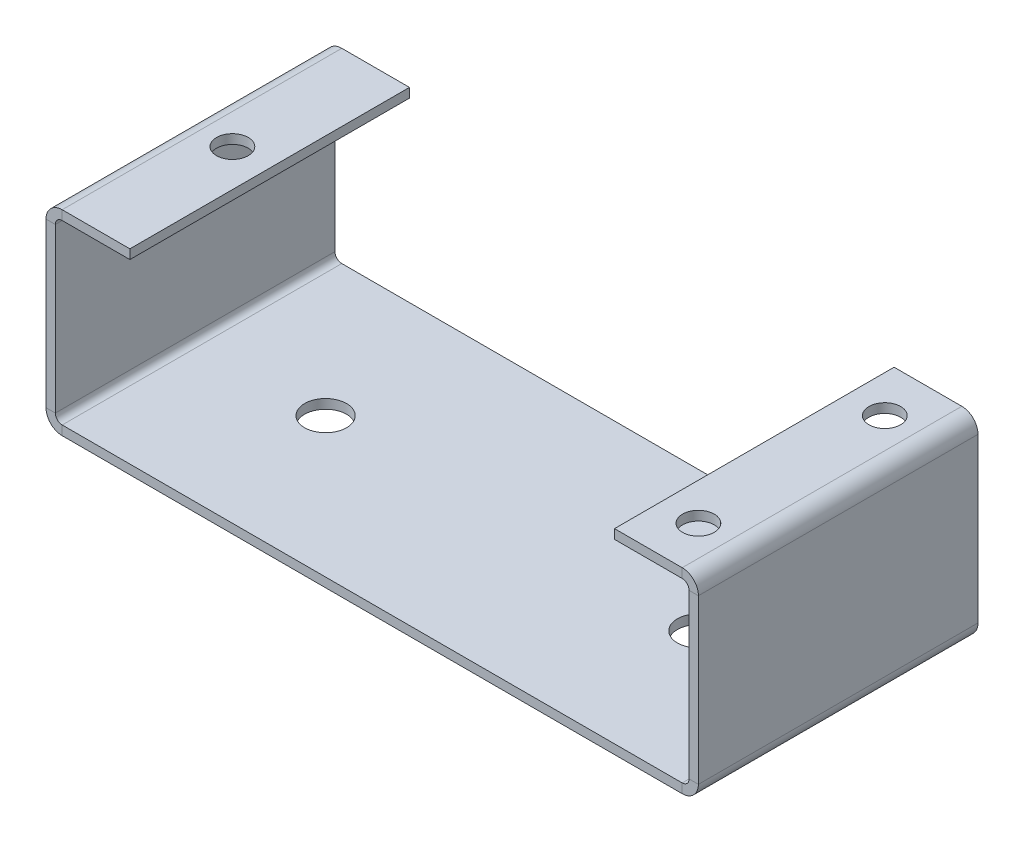
ISO-10303-21;
HEADER;
FILE_DESCRIPTION(('STEP AP214'),'2;1');
FILE_NAME('part.step','',(''),(''),'','','');
FILE_SCHEMA(('AUTOMOTIVE_DESIGN { 1 0 10303 214 1 1 1 1 }'));
ENDSEC;
DATA;
#1=APPLICATION_CONTEXT('core data for automotive mechanical design processes');
#2=APPLICATION_PROTOCOL_DEFINITION('international standard','automotive_design',2000,#1);
#3=PRODUCT_CONTEXT('',#1,'mechanical');
#4=PRODUCT('Part','Part','',(#3));
#5=PRODUCT_RELATED_PRODUCT_CATEGORY('part','',(#4));
#6=PRODUCT_DEFINITION_FORMATION('','',#4);
#7=PRODUCT_DEFINITION_CONTEXT('part definition',#1,'design');
#8=PRODUCT_DEFINITION('design','',#6,#7);
#9=PRODUCT_DEFINITION_SHAPE('','',#8);
#10=(LENGTH_UNIT() NAMED_UNIT(*) SI_UNIT(.MILLI.,.METRE.));
#11=(NAMED_UNIT(*) PLANE_ANGLE_UNIT() SI_UNIT($,.RADIAN.));
#12=(NAMED_UNIT(*) SI_UNIT($,.STERADIAN.) SOLID_ANGLE_UNIT());
#13=UNCERTAINTY_MEASURE_WITH_UNIT(LENGTH_MEASURE(1.E-05),#10,'distance_accuracy_value','');
#14=(GEOMETRIC_REPRESENTATION_CONTEXT(3) GLOBAL_UNCERTAINTY_ASSIGNED_CONTEXT((#13)) GLOBAL_UNIT_ASSIGNED_CONTEXT((#10,
#11,#12)) REPRESENTATION_CONTEXT('',''));
#15=CARTESIAN_POINT('',(0.,0.,0.));
#16=DIRECTION('',(0.,0.,1.));
#17=DIRECTION('',(1.,0.,0.));
#18=AXIS2_PLACEMENT_3D('',#15,#16,#17);
#19=CARTESIAN_POINT('',(35.,0.999999999999997,15.));
#20=DIRECTION('',(0.,0.,-1.));
#21=DIRECTION('',(-1.,0.,0.));
#22=AXIS2_PLACEMENT_3D('',#19,#20,#21);
#23=PLANE('',#22);
#24=DIRECTION('',(1.,0.,0.));
#25=VECTOR('',#24,1.);
#26=CARTESIAN_POINT('',(34.,19.2634,15.));
#27=LINE('',#26,#25);
#28=CARTESIAN_POINT('',(34.,19.2634,15.));
#29=VERTEX_POINT('',#28);
#30=CARTESIAN_POINT('',(35.0000000000001,19.2634,15.));
#31=VERTEX_POINT('',#30);
#32=EDGE_CURVE('E345',#29,#31,#27,.T.);
#33=ORIENTED_EDGE('',*,*,#32,.F.);
#34=DIRECTION('',(0.,1.,0.));
#35=VECTOR('',#34,1.);
#36=CARTESIAN_POINT('',(34.,1.,15.));
#37=LINE('',#36,#35);
#38=CARTESIAN_POINT('',(34.,1.7366,15.));
#39=VERTEX_POINT('',#38);
#40=EDGE_CURVE('E434',#29,#39,#37,.F.);
#41=ORIENTED_EDGE('',*,*,#40,.T.);
#42=DIRECTION('',(-1.,0.,0.));
#43=VECTOR('',#42,1.);
#44=CARTESIAN_POINT('',(35.,1.73659999999999,15.));
#45=LINE('',#44,#43);
#46=CARTESIAN_POINT('',(35.,1.73659999999999,15.));
#47=VERTEX_POINT('',#46);
#48=EDGE_CURVE('E420',#39,#47,#45,.F.);
#49=ORIENTED_EDGE('',*,*,#48,.T.);
#50=DIRECTION('',(0.,-1.,0.));
#51=VECTOR('',#50,1.);
#52=CARTESIAN_POINT('',(35.,-1.2492212465722E-13,15.));
#53=LINE('',#52,#51);
#54=EDGE_CURVE('E428',#31,#47,#53,.T.);
#55=ORIENTED_EDGE('',*,*,#54,.F.);
#56=EDGE_LOOP('',(#33,#41,#49,#55));
#57=FACE_BOUND('',#56,.T.);
#58=ADVANCED_FACE('F125',(#57),#23,.F.);
#59=CARTESIAN_POINT('',(35.0000000000001,21.,-15.));
#60=DIRECTION('',(0.,0.,1.));
#61=DIRECTION('',(1.,0.,0.));
#62=AXIS2_PLACEMENT_3D('',#59,#60,#61);
#63=PLANE('',#62);
#64=DIRECTION('',(1.,0.,0.));
#65=VECTOR('',#64,1.);
#66=CARTESIAN_POINT('',(34.,19.2634,-15.));
#67=LINE('',#66,#65);
#68=CARTESIAN_POINT('',(34.,19.2634,-15.));
#69=VERTEX_POINT('',#68);
#70=CARTESIAN_POINT('',(35.,19.2634,-15.));
#71=VERTEX_POINT('',#70);
#72=EDGE_CURVE('E331',#69,#71,#67,.T.);
#73=ORIENTED_EDGE('',*,*,#72,.T.);
#74=DIRECTION('',(0.,1.,0.));
#75=VECTOR('',#74,1.);
#76=CARTESIAN_POINT('',(35.,-1.2492212465722E-13,-15.));
#77=LINE('',#76,#75);
#78=CARTESIAN_POINT('',(35.,1.73659999999999,-15.));
#79=VERTEX_POINT('',#78);
#80=EDGE_CURVE('E424',#79,#71,#77,.T.);
#81=ORIENTED_EDGE('',*,*,#80,.F.);
#82=DIRECTION('',(-1.,0.,0.));
#83=VECTOR('',#82,1.);
#84=CARTESIAN_POINT('',(34.,1.7366,-15.));
#85=LINE('',#84,#83);
#86=CARTESIAN_POINT('',(34.,1.7366,-15.));
#87=VERTEX_POINT('',#86);
#88=EDGE_CURVE('E441',#87,#79,#85,.F.);
#89=ORIENTED_EDGE('',*,*,#88,.F.);
#90=DIRECTION('',(0.,-1.,0.));
#91=VECTOR('',#90,1.);
#92=CARTESIAN_POINT('',(34.0000000000001,21.,-15.));
#93=LINE('',#92,#91);
#94=EDGE_CURVE('E431',#87,#69,#93,.F.);
#95=ORIENTED_EDGE('',*,*,#94,.T.);
#96=EDGE_LOOP('',(#73,#81,#89,#95));
#97=FACE_BOUND('',#96,.T.);
#98=ADVANCED_FACE('F659',(#97),#63,.F.);
#99=CARTESIAN_POINT('',(35.,-1.2492212465722E-13,0.));
#100=DIRECTION('',(-1.,0.,0.));
#101=DIRECTION('',(0.,-1.,0.));
#102=AXIS2_PLACEMENT_3D('',#99,#100,#101);
#103=PLANE('',#102);
#104=DIRECTION('',(0.,0.,-1.));
#105=VECTOR('',#104,1.);
#106=CARTESIAN_POINT('',(35.,19.2634,-15.));
#107=LINE('',#106,#105);
#108=EDGE_CURVE('E323',#71,#31,#107,.F.);
#109=ORIENTED_EDGE('',*,*,#108,.T.);
#110=ORIENTED_EDGE('',*,*,#54,.T.);
#111=DIRECTION('',(0.,0.,-1.));
#112=VECTOR('',#111,1.);
#113=CARTESIAN_POINT('',(35.,1.73659999999999,15.));
#114=LINE('',#113,#112);
#115=EDGE_CURVE('E437',#79,#47,#114,.F.);
#116=ORIENTED_EDGE('',*,*,#115,.F.);
#117=ORIENTED_EDGE('',*,*,#80,.T.);
#118=EDGE_LOOP('',(#109,#110,#116,#117));
#119=FACE_BOUND('',#118,.T.);
#120=ADVANCED_FACE('F664',(#119),#103,.F.);
#121=CARTESIAN_POINT('',(34.,-1.21430643318376E-13,0.));
#122=DIRECTION('',(-1.,0.,0.));
#123=DIRECTION('',(0.,-1.,0.));
#124=AXIS2_PLACEMENT_3D('',#121,#122,#123);
#125=PLANE('',#124);
#126=ORIENTED_EDGE('',*,*,#40,.F.);
#127=DIRECTION('',(0.,0.,-1.));
#128=VECTOR('',#127,1.);
#129=CARTESIAN_POINT('',(34.,19.2634,-15.));
#130=LINE('',#129,#128);
#131=EDGE_CURVE('E143',#69,#29,#130,.F.);
#132=ORIENTED_EDGE('',*,*,#131,.F.);
#133=ORIENTED_EDGE('',*,*,#94,.F.);
#134=DIRECTION('',(0.,0.,-1.));
#135=VECTOR('',#134,1.);
#136=CARTESIAN_POINT('',(34.,1.7366,15.));
#137=LINE('',#136,#135);
#138=EDGE_CURVE('E445',#39,#87,#137,.T.);
#139=ORIENTED_EDGE('',*,*,#138,.F.);
#140=EDGE_LOOP('',(#126,#132,#133,#139));
#141=FACE_BOUND('',#140,.T.);
#142=ADVANCED_FACE('F577',(#141),#125,.T.);
#143=CARTESIAN_POINT('',(-35.,0.999999999999997,-15.));
#144=DIRECTION('',(0.,0.,1.));
#145=DIRECTION('',(0.,-1.,0.));
#146=AXIS2_PLACEMENT_3D('',#143,#144,#145);
#147=PLANE('',#146);
#148=DIRECTION('',(-1.,0.,0.));
#149=VECTOR('',#148,1.);
#150=CARTESIAN_POINT('',(-34.0000000000001,19.2634,-15.));
#151=LINE('',#150,#149);
#152=CARTESIAN_POINT('',(-34.0000000000001,19.2634,-15.));
#153=VERTEX_POINT('',#152);
#154=CARTESIAN_POINT('',(-35.0000000000001,19.2634,-15.));
#155=VERTEX_POINT('',#154);
#156=EDGE_CURVE('E416',#153,#155,#151,.T.);
#157=ORIENTED_EDGE('',*,*,#156,.F.);
#158=DIRECTION('',(0.,1.,0.));
#159=VECTOR('',#158,1.);
#160=CARTESIAN_POINT('',(-34.,1.,-15.));
#161=LINE('',#160,#159);
#162=CARTESIAN_POINT('',(-34.,1.7366,-15.));
#163=VERTEX_POINT('',#162);
#164=EDGE_CURVE('E492',#153,#163,#161,.F.);
#165=ORIENTED_EDGE('',*,*,#164,.T.);
#166=DIRECTION('',(1.,0.,0.));
#167=VECTOR('',#166,1.);
#168=CARTESIAN_POINT('',(-35.,1.73659999999999,-15.));
#169=LINE('',#168,#167);
#170=CARTESIAN_POINT('',(-35.,1.73659999999999,-15.));
#171=VERTEX_POINT('',#170);
#172=EDGE_CURVE('E478',#163,#171,#169,.F.);
#173=ORIENTED_EDGE('',*,*,#172,.T.);
#174=DIRECTION('',(0.,-1.,0.));
#175=VECTOR('',#174,1.);
#176=CARTESIAN_POINT('',(-35.,-1.26223167264202E-13,-15.));
#177=LINE('',#176,#175);
#178=EDGE_CURVE('E486',#155,#171,#177,.T.);
#179=ORIENTED_EDGE('',*,*,#178,.F.);
#180=EDGE_LOOP('',(#157,#165,#173,#179));
#181=FACE_BOUND('',#180,.T.);
#182=ADVANCED_FACE('F689',(#181),#147,.F.);
#183=CARTESIAN_POINT('',(-35.0000000000001,21.,15.));
#184=DIRECTION('',(0.,0.,-1.));
#185=DIRECTION('',(0.,1.,0.));
#186=AXIS2_PLACEMENT_3D('',#183,#184,#185);
#187=PLANE('',#186);
#188=DIRECTION('',(-1.,0.,0.));
#189=VECTOR('',#188,1.);
#190=CARTESIAN_POINT('',(-34.0000000000001,19.2634,15.));
#191=LINE('',#190,#189);
#192=CARTESIAN_POINT('',(-34.0000000000001,19.2634,15.));
#193=VERTEX_POINT('',#192);
#194=CARTESIAN_POINT('',(-35.0000000000001,19.2634,15.));
#195=VERTEX_POINT('',#194);
#196=EDGE_CURVE('E403',#193,#195,#191,.T.);
#197=ORIENTED_EDGE('',*,*,#196,.T.);
#198=DIRECTION('',(0.,1.,0.));
#199=VECTOR('',#198,1.);
#200=CARTESIAN_POINT('',(-35.,-1.23621082050237E-13,15.));
#201=LINE('',#200,#199);
#202=CARTESIAN_POINT('',(-35.,1.73659999999999,15.));
#203=VERTEX_POINT('',#202);
#204=EDGE_CURVE('E482',#203,#195,#201,.T.);
#205=ORIENTED_EDGE('',*,*,#204,.F.);
#206=DIRECTION('',(1.,0.,0.));
#207=VECTOR('',#206,1.);
#208=CARTESIAN_POINT('',(-34.,1.7366,15.));
#209=LINE('',#208,#207);
#210=CARTESIAN_POINT('',(-34.,1.7366,15.));
#211=VERTEX_POINT('',#210);
#212=EDGE_CURVE('E499',#211,#203,#209,.F.);
#213=ORIENTED_EDGE('',*,*,#212,.F.);
#214=DIRECTION('',(0.,-1.,0.));
#215=VECTOR('',#214,1.);
#216=CARTESIAN_POINT('',(-34.0000000000001,21.,15.));
#217=LINE('',#216,#215);
#218=EDGE_CURVE('E489',#211,#193,#217,.F.);
#219=ORIENTED_EDGE('',*,*,#218,.T.);
#220=EDGE_LOOP('',(#197,#205,#213,#219));
#221=FACE_BOUND('',#220,.T.);
#222=ADVANCED_FACE('F683',(#221),#187,.F.);
#223=CARTESIAN_POINT('',(-35.,-1.2492212465722E-13,0.));
#224=DIRECTION('',(1.,0.,0.));
#225=DIRECTION('',(0.,1.,0.));
#226=AXIS2_PLACEMENT_3D('',#223,#224,#225);
#227=PLANE('',#226);
#228=DIRECTION('',(0.,0.,1.));
#229=VECTOR('',#228,1.);
#230=CARTESIAN_POINT('',(-35.0000000000001,19.2634,15.));
#231=LINE('',#230,#229);
#232=EDGE_CURVE('E395',#195,#155,#231,.F.);
#233=ORIENTED_EDGE('',*,*,#232,.T.);
#234=ORIENTED_EDGE('',*,*,#178,.T.);
#235=DIRECTION('',(0.,0.,1.));
#236=VECTOR('',#235,1.);
#237=CARTESIAN_POINT('',(-35.,1.73659999999999,-15.));
#238=LINE('',#237,#236);
#239=EDGE_CURVE('E495',#203,#171,#238,.F.);
#240=ORIENTED_EDGE('',*,*,#239,.F.);
#241=ORIENTED_EDGE('',*,*,#204,.T.);
#242=EDGE_LOOP('',(#233,#234,#240,#241));
#243=FACE_BOUND('',#242,.T.);
#244=ADVANCED_FACE('F679',(#243),#227,.F.);
#245=CARTESIAN_POINT('',(-34.,-1.21430643318377E-13,0.));
#246=DIRECTION('',(1.,0.,0.));
#247=DIRECTION('',(0.,1.,0.));
#248=AXIS2_PLACEMENT_3D('',#245,#246,#247);
#249=PLANE('',#248);
#250=ORIENTED_EDGE('',*,*,#164,.F.);
#251=DIRECTION('',(0.,0.,1.));
#252=VECTOR('',#251,1.);
#253=CARTESIAN_POINT('',(-34.0000000000001,19.2634,15.));
#254=LINE('',#253,#252);
#255=EDGE_CURVE('E151',#193,#153,#254,.F.);
#256=ORIENTED_EDGE('',*,*,#255,.F.);
#257=ORIENTED_EDGE('',*,*,#218,.F.);
#258=DIRECTION('',(0.,0.,1.));
#259=VECTOR('',#258,1.);
#260=CARTESIAN_POINT('',(-34.,1.7366,-15.));
#261=LINE('',#260,#259);
#262=EDGE_CURVE('E503',#163,#211,#261,.T.);
#263=ORIENTED_EDGE('',*,*,#262,.F.);
#264=EDGE_LOOP('',(#250,#256,#257,#263));
#265=FACE_BOUND('',#264,.T.);
#266=ADVANCED_FACE('F682',(#265),#249,.T.);
#267=CARTESIAN_POINT('',(-35.,1.,-15.));
#268=DIRECTION('',(0.,0.,1.));
#269=DIRECTION('',(1.,0.,0.));
#270=AXIS2_PLACEMENT_3D('',#267,#268,#269);
#271=PLANE('',#270);
#272=DIRECTION('',(0.,-1.,0.));
#273=VECTOR('',#272,1.);
#274=CARTESIAN_POINT('',(33.2634,1.,-15.));
#275=LINE('',#274,#273);
#276=CARTESIAN_POINT('',(33.2634,1.,-15.));
#277=VERTEX_POINT('',#276);
#278=CARTESIAN_POINT('',(33.2634,0.,-15.));
#279=VERTEX_POINT('',#278);
#280=EDGE_CURVE('E460',#277,#279,#275,.T.);
#281=ORIENTED_EDGE('',*,*,#280,.T.);
#282=DIRECTION('',(-1.,0.,0.));
#283=VECTOR('',#282,1.);
#284=CARTESIAN_POINT('',(-35.,0.,-15.));
#285=LINE('',#284,#283);
#286=CARTESIAN_POINT('',(-33.2634,0.,-15.));
#287=VERTEX_POINT('',#286);
#288=EDGE_CURVE('E536',#279,#287,#285,.T.);
#289=ORIENTED_EDGE('',*,*,#288,.T.);
#290=DIRECTION('',(0.,-1.,0.));
#291=VECTOR('',#290,1.);
#292=CARTESIAN_POINT('',(-33.2634,1.,-15.));
#293=LINE('',#292,#291);
#294=CARTESIAN_POINT('',(-33.2634,1.,-15.));
#295=VERTEX_POINT('',#294);
#296=EDGE_CURVE('E532',#295,#287,#293,.T.);
#297=ORIENTED_EDGE('',*,*,#296,.F.);
#298=DIRECTION('',(-1.,0.,0.));
#299=VECTOR('',#298,1.);
#300=CARTESIAN_POINT('',(-35.,1.,-15.));
#301=LINE('',#300,#299);
#302=EDGE_CURVE('E135',#277,#295,#301,.T.);
#303=ORIENTED_EDGE('',*,*,#302,.F.);
#304=EDGE_LOOP('',(#281,#289,#297,#303));
#305=FACE_BOUND('',#304,.T.);
#306=ADVANCED_FACE('F127',(#305),#271,.F.);
#307=CARTESIAN_POINT('',(-35.,1.,15.));
#308=DIRECTION('',(0.,0.,-1.));
#309=DIRECTION('',(-1.,0.,0.));
#310=AXIS2_PLACEMENT_3D('',#307,#308,#309);
#311=PLANE('',#310);
#312=DIRECTION('',(0.,-1.,0.));
#313=VECTOR('',#312,1.);
#314=CARTESIAN_POINT('',(33.2634,1.,15.));
#315=LINE('',#314,#313);
#316=CARTESIAN_POINT('',(33.2634,1.,15.));
#317=VERTEX_POINT('',#316);
#318=CARTESIAN_POINT('',(33.2634,0.,15.));
#319=VERTEX_POINT('',#318);
#320=EDGE_CURVE('E474',#317,#319,#315,.T.);
#321=ORIENTED_EDGE('',*,*,#320,.F.);
#322=DIRECTION('',(1.,0.,0.));
#323=VECTOR('',#322,1.);
#324=CARTESIAN_POINT('',(-35.,1.,15.));
#325=LINE('',#324,#323);
#326=CARTESIAN_POINT('',(-33.2634,1.,15.));
#327=VERTEX_POINT('',#326);
#328=EDGE_CURVE('E13',#327,#317,#325,.T.);
#329=ORIENTED_EDGE('',*,*,#328,.F.);
#330=DIRECTION('',(0.,-1.,0.));
#331=VECTOR('',#330,1.);
#332=CARTESIAN_POINT('',(-33.2634,1.,15.));
#333=LINE('',#332,#331);
#334=CARTESIAN_POINT('',(-33.2634,0.,15.));
#335=VERTEX_POINT('',#334);
#336=EDGE_CURVE('E518',#327,#335,#333,.T.);
#337=ORIENTED_EDGE('',*,*,#336,.T.);
#338=DIRECTION('',(1.,0.,0.));
#339=VECTOR('',#338,1.);
#340=CARTESIAN_POINT('',(-35.,0.,15.));
#341=LINE('',#340,#339);
#342=EDGE_CURVE('E129',#335,#319,#341,.T.);
#343=ORIENTED_EDGE('',*,*,#342,.T.);
#344=EDGE_LOOP('',(#321,#329,#337,#343));
#345=FACE_BOUND('',#344,.T.);
#346=ADVANCED_FACE('F552',(#345),#311,.F.);
#347=CARTESIAN_POINT('',(0.,1.,0.));
#348=DIRECTION('',(0.,-1.,0.));
#349=DIRECTION('',(0.,0.,-1.));
#350=AXIS2_PLACEMENT_3D('',#347,#348,#349);
#351=PLANE('',#350);
#352=CARTESIAN_POINT('',(-20.,1.,0.));
#353=DIRECTION('',(0.,1.,0.));
#354=DIRECTION('',(0.,0.,1.));
#355=AXIS2_PLACEMENT_3D('',#352,#353,#354);
#356=CIRCLE('',#355,2.25);
#357=CARTESIAN_POINT('',(-20.,1.,2.25));
#358=VERTEX_POINT('',#357);
#359=EDGE_CURVE('E600',#358,#358,#356,.T.);
#360=ORIENTED_EDGE('',*,*,#359,.F.);
#361=EDGE_LOOP('',(#360));
#362=FACE_BOUND('',#361,.T.);
#363=CARTESIAN_POINT('',(20.,1.,0.));
#364=DIRECTION('',(0.,1.,0.));
#365=DIRECTION('',(0.,0.,-1.));
#366=AXIS2_PLACEMENT_3D('',#363,#364,#365);
#367=CIRCLE('',#366,2.25);
#368=CARTESIAN_POINT('',(20.,1.,-2.25));
#369=VERTEX_POINT('',#368);
#370=EDGE_CURVE('E619',#369,#369,#367,.T.);
#371=ORIENTED_EDGE('',*,*,#370,.F.);
#372=EDGE_LOOP('',(#371));
#373=FACE_BOUND('',#372,.T.);
#374=DIRECTION('',(0.,0.,-1.));
#375=VECTOR('',#374,1.);
#376=CARTESIAN_POINT('',(33.2634,1.,-15.));
#377=LINE('',#376,#375);
#378=EDGE_CURVE('E468',#277,#317,#377,.F.);
#379=ORIENTED_EDGE('',*,*,#378,.F.);
#380=ORIENTED_EDGE('',*,*,#302,.T.);
#381=DIRECTION('',(0.,0.,1.));
#382=VECTOR('',#381,1.);
#383=CARTESIAN_POINT('',(-33.2634,1.,15.));
#384=LINE('',#383,#382);
#385=EDGE_CURVE('E526',#327,#295,#384,.F.);
#386=ORIENTED_EDGE('',*,*,#385,.F.);
#387=ORIENTED_EDGE('',*,*,#328,.T.);
#388=EDGE_LOOP('',(#379,#380,#386,#387));
#389=FACE_BOUND('',#388,.T.);
#390=ADVANCED_FACE('F567',(#362,#373,#389),#351,.F.);
#391=CARTESIAN_POINT('',(0.,0.,0.));
#392=DIRECTION('',(0.,-1.,0.));
#393=DIRECTION('',(0.,0.,-1.));
#394=AXIS2_PLACEMENT_3D('',#391,#392,#393);
#395=PLANE('',#394);
#396=CARTESIAN_POINT('',(-20.,0.,0.));
#397=DIRECTION('',(0.,-1.,0.));
#398=DIRECTION('',(0.,0.,-1.));
#399=AXIS2_PLACEMENT_3D('',#396,#397,#398);
#400=CIRCLE('',#399,2.25);
#401=CARTESIAN_POINT('',(-20.,0.,-2.25));
#402=VERTEX_POINT('',#401);
#403=EDGE_CURVE('E627',#402,#402,#400,.F.);
#404=ORIENTED_EDGE('',*,*,#403,.T.);
#405=EDGE_LOOP('',(#404));
#406=FACE_BOUND('',#405,.T.);
#407=CARTESIAN_POINT('',(20.,0.,0.));
#408=DIRECTION('',(0.,-1.,0.));
#409=DIRECTION('',(0.,0.,-1.));
#410=AXIS2_PLACEMENT_3D('',#407,#408,#409);
#411=CIRCLE('',#410,2.25);
#412=CARTESIAN_POINT('',(20.,0.,-2.25));
#413=VERTEX_POINT('',#412);
#414=EDGE_CURVE('E623',#413,#413,#411,.F.);
#415=ORIENTED_EDGE('',*,*,#414,.T.);
#416=EDGE_LOOP('',(#415));
#417=FACE_BOUND('',#416,.T.);
#418=ORIENTED_EDGE('',*,*,#288,.F.);
#419=DIRECTION('',(0.,0.,-1.));
#420=VECTOR('',#419,1.);
#421=CARTESIAN_POINT('',(33.2634,0.,-15.));
#422=LINE('',#421,#420);
#423=EDGE_CURVE('E451',#279,#319,#422,.F.);
#424=ORIENTED_EDGE('',*,*,#423,.T.);
#425=ORIENTED_EDGE('',*,*,#342,.F.);
#426=DIRECTION('',(0.,0.,1.));
#427=VECTOR('',#426,1.);
#428=CARTESIAN_POINT('',(-33.2634,0.,15.));
#429=LINE('',#428,#427);
#430=EDGE_CURVE('E509',#335,#287,#429,.F.);
#431=ORIENTED_EDGE('',*,*,#430,.T.);
#432=EDGE_LOOP('',(#418,#424,#425,#431));
#433=FACE_BOUND('',#432,.T.);
#434=ADVANCED_FACE('F555',(#406,#417,#433),#395,.T.);
#435=CARTESIAN_POINT('',(-33.2634,1.7366,-15.));
#436=DIRECTION('',(0.,0.,-1.));
#437=DIRECTION('',(-1.,0.,0.));
#438=AXIS2_PLACEMENT_3D('',#435,#436,#437);
#439=PLANE('',#438);
#440=ORIENTED_EDGE('',*,*,#172,.F.);
#441=CARTESIAN_POINT('',(-33.2634,1.7366,-15.));
#442=DIRECTION('',(0.,0.,1.));
#443=DIRECTION('',(1.,0.,0.));
#444=AXIS2_PLACEMENT_3D('',#441,#442,#443);
#445=CIRCLE('',#444,0.736599999999997);
#446=EDGE_CURVE('E522',#295,#163,#445,.F.);
#447=ORIENTED_EDGE('',*,*,#446,.F.);
#448=ORIENTED_EDGE('',*,*,#296,.T.);
#449=CARTESIAN_POINT('',(-33.2634,1.7366,-15.));
#450=DIRECTION('',(0.,0.,1.));
#451=DIRECTION('',(1.,0.,0.));
#452=AXIS2_PLACEMENT_3D('',#449,#450,#451);
#453=CIRCLE('',#452,1.7366);
#454=EDGE_CURVE('E513',#287,#171,#453,.F.);
#455=ORIENTED_EDGE('',*,*,#454,.T.);
#456=EDGE_LOOP('',(#440,#447,#448,#455));
#457=FACE_BOUND('',#456,.T.);
#458=ADVANCED_FACE('F702',(#457),#439,.T.);
#459=CARTESIAN_POINT('',(-33.2634,1.7366,15.));
#460=DIRECTION('',(0.,0.,-1.));
#461=DIRECTION('',(-1.,0.,0.));
#462=AXIS2_PLACEMENT_3D('',#459,#460,#461);
#463=PLANE('',#462);
#464=CARTESIAN_POINT('',(-33.2634,1.7366,15.));
#465=DIRECTION('',(0.,0.,1.));
#466=DIRECTION('',(1.,0.,0.));
#467=AXIS2_PLACEMENT_3D('',#464,#465,#466);
#468=CIRCLE('',#467,0.736599999999997);
#469=EDGE_CURVE('E485',#211,#327,#468,.T.);
#470=ORIENTED_EDGE('',*,*,#469,.F.);
#471=ORIENTED_EDGE('',*,*,#212,.T.);
#472=CARTESIAN_POINT('',(-33.2634,1.7366,15.));
#473=DIRECTION('',(0.,0.,1.));
#474=DIRECTION('',(1.,0.,0.));
#475=AXIS2_PLACEMENT_3D('',#472,#473,#474);
#476=CIRCLE('',#475,1.7366);
#477=EDGE_CURVE('E514',#203,#335,#476,.T.);
#478=ORIENTED_EDGE('',*,*,#477,.T.);
#479=ORIENTED_EDGE('',*,*,#336,.F.);
#480=EDGE_LOOP('',(#470,#471,#478,#479));
#481=FACE_BOUND('',#480,.T.);
#482=ADVANCED_FACE('F697',(#481),#463,.F.);
#483=CARTESIAN_POINT('',(-33.2634,1.7366,15.));
#484=DIRECTION('',(0.,0.,1.));
#485=DIRECTION('',(-1.,0.,0.));
#486=AXIS2_PLACEMENT_3D('',#483,#484,#485);
#487=CYLINDRICAL_SURFACE('',#486,1.7366);
#488=ORIENTED_EDGE('',*,*,#430,.F.);
#489=ORIENTED_EDGE('',*,*,#477,.F.);
#490=ORIENTED_EDGE('',*,*,#239,.T.);
#491=ORIENTED_EDGE('',*,*,#454,.F.);
#492=EDGE_LOOP('',(#488,#489,#490,#491));
#493=FACE_BOUND('',#492,.T.);
#494=ADVANCED_FACE('F694',(#493),#487,.T.);
#495=CARTESIAN_POINT('',(-33.2634,1.7366,15.));
#496=DIRECTION('',(0.,0.,1.));
#497=DIRECTION('',(-1.,0.,0.));
#498=AXIS2_PLACEMENT_3D('',#495,#496,#497);
#499=CYLINDRICAL_SURFACE('',#498,0.736599999999997);
#500=ORIENTED_EDGE('',*,*,#385,.T.);
#501=ORIENTED_EDGE('',*,*,#446,.T.);
#502=ORIENTED_EDGE('',*,*,#262,.T.);
#503=ORIENTED_EDGE('',*,*,#469,.T.);
#504=EDGE_LOOP('',(#500,#501,#502,#503));
#505=FACE_BOUND('',#504,.T.);
#506=ADVANCED_FACE('F676',(#505),#499,.F.);
#507=CARTESIAN_POINT('',(33.2634,1.7366,15.));
#508=DIRECTION('',(0.,0.,1.));
#509=DIRECTION('',(1.,0.,0.));
#510=AXIS2_PLACEMENT_3D('',#507,#508,#509);
#511=PLANE('',#510);
#512=ORIENTED_EDGE('',*,*,#48,.F.);
#513=CARTESIAN_POINT('',(33.2634,1.7366,15.));
#514=DIRECTION('',(0.,0.,-1.));
#515=DIRECTION('',(-1.,0.,0.));
#516=AXIS2_PLACEMENT_3D('',#513,#514,#515);
#517=CIRCLE('',#516,0.736599999999997);
#518=EDGE_CURVE('E464',#317,#39,#517,.F.);
#519=ORIENTED_EDGE('',*,*,#518,.F.);
#520=ORIENTED_EDGE('',*,*,#320,.T.);
#521=CARTESIAN_POINT('',(33.2634,1.7366,15.));
#522=DIRECTION('',(0.,0.,-1.));
#523=DIRECTION('',(-1.,0.,0.));
#524=AXIS2_PLACEMENT_3D('',#521,#522,#523);
#525=CIRCLE('',#524,1.7366);
#526=EDGE_CURVE('E455',#319,#47,#525,.F.);
#527=ORIENTED_EDGE('',*,*,#526,.T.);
#528=EDGE_LOOP('',(#512,#519,#520,#527));
#529=FACE_BOUND('',#528,.T.);
#530=ADVANCED_FACE('F574',(#529),#511,.T.);
#531=CARTESIAN_POINT('',(33.2634,1.7366,-15.));
#532=DIRECTION('',(0.,0.,1.));
#533=DIRECTION('',(1.,0.,0.));
#534=AXIS2_PLACEMENT_3D('',#531,#532,#533);
#535=PLANE('',#534);
#536=CARTESIAN_POINT('',(33.2634,1.7366,-15.));
#537=DIRECTION('',(0.,0.,-1.));
#538=DIRECTION('',(-1.,0.,0.));
#539=AXIS2_PLACEMENT_3D('',#536,#537,#538);
#540=CIRCLE('',#539,0.736599999999997);
#541=EDGE_CURVE('E427',#87,#277,#540,.T.);
#542=ORIENTED_EDGE('',*,*,#541,.F.);
#543=ORIENTED_EDGE('',*,*,#88,.T.);
#544=CARTESIAN_POINT('',(33.2634,1.7366,-15.));
#545=DIRECTION('',(0.,0.,-1.));
#546=DIRECTION('',(-1.,0.,0.));
#547=AXIS2_PLACEMENT_3D('',#544,#545,#546);
#548=CIRCLE('',#547,1.7366);
#549=EDGE_CURVE('E456',#79,#279,#548,.T.);
#550=ORIENTED_EDGE('',*,*,#549,.T.);
#551=ORIENTED_EDGE('',*,*,#280,.F.);
#552=EDGE_LOOP('',(#542,#543,#550,#551));
#553=FACE_BOUND('',#552,.T.);
#554=ADVANCED_FACE('F560',(#553),#535,.F.);
#555=CARTESIAN_POINT('',(33.2634,1.7366,-15.));
#556=DIRECTION('',(0.,0.,-1.));
#557=DIRECTION('',(1.,0.,0.));
#558=AXIS2_PLACEMENT_3D('',#555,#556,#557);
#559=CYLINDRICAL_SURFACE('',#558,1.7366);
#560=ORIENTED_EDGE('',*,*,#423,.F.);
#561=ORIENTED_EDGE('',*,*,#549,.F.);
#562=ORIENTED_EDGE('',*,*,#115,.T.);
#563=ORIENTED_EDGE('',*,*,#526,.F.);
#564=EDGE_LOOP('',(#560,#561,#562,#563));
#565=FACE_BOUND('',#564,.T.);
#566=ADVANCED_FACE('F557',(#565),#559,.T.);
#567=CARTESIAN_POINT('',(33.2634,1.7366,-15.));
#568=DIRECTION('',(0.,0.,-1.));
#569=DIRECTION('',(1.,0.,0.));
#570=AXIS2_PLACEMENT_3D('',#567,#568,#569);
#571=CYLINDRICAL_SURFACE('',#570,0.736599999999997);
#572=ORIENTED_EDGE('',*,*,#378,.T.);
#573=ORIENTED_EDGE('',*,*,#518,.T.);
#574=ORIENTED_EDGE('',*,*,#138,.T.);
#575=ORIENTED_EDGE('',*,*,#541,.T.);
#576=EDGE_LOOP('',(#572,#573,#574,#575));
#577=FACE_BOUND('',#576,.T.);
#578=ADVANCED_FACE('F570',(#577),#571,.F.);
#579=CARTESIAN_POINT('',(-33.2634000000001,19.2634,-15.));
#580=DIRECTION('',(0.,0.,-1.));
#581=DIRECTION('',(-1.,0.,0.));
#582=AXIS2_PLACEMENT_3D('',#579,#580,#581);
#583=PLANE('',#582);
#584=DIRECTION('',(0.,-1.,0.));
#585=VECTOR('',#584,1.);
#586=CARTESIAN_POINT('',(-33.2634000000001,21.,-15.));
#587=LINE('',#586,#585);
#588=CARTESIAN_POINT('',(-33.2634000000001,20.,-15.));
#589=VERTEX_POINT('',#588);
#590=CARTESIAN_POINT('',(-33.2634000000001,21.,-15.));
#591=VERTEX_POINT('',#590);
#592=EDGE_CURVE('E349',#589,#591,#587,.F.);
#593=ORIENTED_EDGE('',*,*,#592,.F.);
#594=CARTESIAN_POINT('',(-33.2634000000001,19.2634,-15.));
#595=DIRECTION('',(0.,0.,1.));
#596=DIRECTION('',(1.,0.,0.));
#597=AXIS2_PLACEMENT_3D('',#594,#595,#596);
#598=CIRCLE('',#597,0.7366);
#599=EDGE_CURVE('E407',#153,#589,#598,.F.);
#600=ORIENTED_EDGE('',*,*,#599,.F.);
#601=ORIENTED_EDGE('',*,*,#156,.T.);
#602=CARTESIAN_POINT('',(-33.2634000000001,19.2634,-15.));
#603=DIRECTION('',(0.,0.,1.));
#604=DIRECTION('',(1.,0.,0.));
#605=AXIS2_PLACEMENT_3D('',#602,#603,#604);
#606=CIRCLE('',#605,1.7366);
#607=EDGE_CURVE('E398',#155,#591,#606,.F.);
#608=ORIENTED_EDGE('',*,*,#607,.T.);
#609=EDGE_LOOP('',(#593,#600,#601,#608));
#610=FACE_BOUND('',#609,.T.);
#611=ADVANCED_FACE('F673',(#610),#583,.T.);
#612=CARTESIAN_POINT('',(-33.2634000000001,19.2634,15.));
#613=DIRECTION('',(0.,0.,-1.));
#614=DIRECTION('',(-1.,0.,0.));
#615=AXIS2_PLACEMENT_3D('',#612,#613,#614);
#616=PLANE('',#615);
#617=CARTESIAN_POINT('',(-33.2634000000001,19.2634,15.));
#618=DIRECTION('',(0.,0.,1.));
#619=DIRECTION('',(1.,0.,0.));
#620=AXIS2_PLACEMENT_3D('',#617,#618,#619);
#621=CIRCLE('',#620,0.7366);
#622=CARTESIAN_POINT('',(-33.2634000000001,20.,15.));
#623=VERTEX_POINT('',#622);
#624=EDGE_CURVE('E357',#623,#193,#621,.T.);
#625=ORIENTED_EDGE('',*,*,#624,.F.);
#626=DIRECTION('',(0.,-1.,0.));
#627=VECTOR('',#626,1.);
#628=CARTESIAN_POINT('',(-33.2634000000001,20.,15.));
#629=LINE('',#628,#627);
#630=CARTESIAN_POINT('',(-33.2634000000001,21.,15.));
#631=VERTEX_POINT('',#630);
#632=EDGE_CURVE('E385',#623,#631,#629,.F.);
#633=ORIENTED_EDGE('',*,*,#632,.T.);
#634=CARTESIAN_POINT('',(-33.2634000000001,19.2634,15.));
#635=DIRECTION('',(0.,0.,1.));
#636=DIRECTION('',(1.,0.,0.));
#637=AXIS2_PLACEMENT_3D('',#634,#635,#636);
#638=CIRCLE('',#637,1.7366);
#639=EDGE_CURVE('E399',#631,#195,#638,.T.);
#640=ORIENTED_EDGE('',*,*,#639,.T.);
#641=ORIENTED_EDGE('',*,*,#196,.F.);
#642=EDGE_LOOP('',(#625,#633,#640,#641));
#643=FACE_BOUND('',#642,.T.);
#644=ADVANCED_FACE('F907',(#643),#616,.F.);
#645=CARTESIAN_POINT('',(-33.2634000000001,19.2634,15.));
#646=DIRECTION('',(0.,0.,1.));
#647=DIRECTION('',(0.,1.,0.));
#648=AXIS2_PLACEMENT_3D('',#645,#646,#647);
#649=CYLINDRICAL_SURFACE('',#648,1.7366);
#650=ORIENTED_EDGE('',*,*,#232,.F.);
#651=ORIENTED_EDGE('',*,*,#639,.F.);
#652=DIRECTION('',(0.,0.,1.));
#653=VECTOR('',#652,1.);
#654=CARTESIAN_POINT('',(-33.2634000000001,21.,-15.));
#655=LINE('',#654,#653);
#656=EDGE_CURVE('E382',#631,#591,#655,.F.);
#657=ORIENTED_EDGE('',*,*,#656,.T.);
#658=ORIENTED_EDGE('',*,*,#607,.F.);
#659=EDGE_LOOP('',(#650,#651,#657,#658));
#660=FACE_BOUND('',#659,.T.);
#661=ADVANCED_FACE('F918',(#660),#649,.T.);
#662=CARTESIAN_POINT('',(-33.2634000000001,19.2634,15.));
#663=DIRECTION('',(0.,0.,1.));
#664=DIRECTION('',(0.,1.,0.));
#665=AXIS2_PLACEMENT_3D('',#662,#663,#664);
#666=CYLINDRICAL_SURFACE('',#665,0.7366);
#667=ORIENTED_EDGE('',*,*,#255,.T.);
#668=ORIENTED_EDGE('',*,*,#599,.T.);
#669=DIRECTION('',(0.,0.,1.));
#670=VECTOR('',#669,1.);
#671=CARTESIAN_POINT('',(-33.2634000000001,20.,-15.));
#672=LINE('',#671,#670);
#673=EDGE_CURVE('E389',#589,#623,#672,.T.);
#674=ORIENTED_EDGE('',*,*,#673,.T.);
#675=ORIENTED_EDGE('',*,*,#624,.T.);
#676=EDGE_LOOP('',(#667,#668,#674,#675));
#677=FACE_BOUND('',#676,.T.);
#678=ADVANCED_FACE('F930',(#677),#666,.F.);
#679=CARTESIAN_POINT('',(-26.0000000000001,21.0000000000001,15.));
#680=DIRECTION('',(0.,0.,-1.));
#681=DIRECTION('',(-1.,0.,0.));
#682=AXIS2_PLACEMENT_3D('',#679,#680,#681);
#683=PLANE('',#682);
#684=ORIENTED_EDGE('',*,*,#632,.F.);
#685=DIRECTION('',(-1.,0.,0.));
#686=VECTOR('',#685,1.);
#687=CARTESIAN_POINT('',(-26.0000000000001,20.0000000000001,15.));
#688=LINE('',#687,#686);
#689=CARTESIAN_POINT('',(-26.0000000000001,20.0000000000001,15.));
#690=VERTEX_POINT('',#689);
#691=EDGE_CURVE('E379',#623,#690,#688,.F.);
#692=ORIENTED_EDGE('',*,*,#691,.T.);
#693=DIRECTION('',(0.,-1.,0.));
#694=VECTOR('',#693,1.);
#695=CARTESIAN_POINT('',(-26.0000000000001,21.0000000000001,15.));
#696=LINE('',#695,#694);
#697=CARTESIAN_POINT('',(-26.0000000000001,21.0000000000001,15.));
#698=VERTEX_POINT('',#697);
#699=EDGE_CURVE('E353',#698,#690,#696,.T.);
#700=ORIENTED_EDGE('',*,*,#699,.F.);
#701=DIRECTION('',(1.,0.,0.));
#702=VECTOR('',#701,1.);
#703=CARTESIAN_POINT('',(-1.49208253320896E-13,21.0000000000002,15.));
#704=LINE('',#703,#702);
#705=EDGE_CURVE('E369',#631,#698,#704,.T.);
#706=ORIENTED_EDGE('',*,*,#705,.F.);
#707=EDGE_LOOP('',(#684,#692,#700,#706));
#708=FACE_BOUND('',#707,.T.);
#709=ADVANCED_FACE('F942',(#708),#683,.F.);
#710=CARTESIAN_POINT('',(-34.0000000000001,21.,-15.));
#711=DIRECTION('',(0.,0.,1.));
#712=DIRECTION('',(1.,0.,0.));
#713=AXIS2_PLACEMENT_3D('',#710,#711,#712);
#714=PLANE('',#713);
#715=ORIENTED_EDGE('',*,*,#592,.T.);
#716=DIRECTION('',(-1.,0.,0.));
#717=VECTOR('',#716,1.);
#718=CARTESIAN_POINT('',(-1.49208253320896E-13,21.0000000000002,-15.));
#719=LINE('',#718,#717);
#720=CARTESIAN_POINT('',(-26.0000000000001,21.0000000000001,-15.));
#721=VERTEX_POINT('',#720);
#722=EDGE_CURVE('E362',#721,#591,#719,.T.);
#723=ORIENTED_EDGE('',*,*,#722,.F.);
#724=DIRECTION('',(0.,-1.,0.));
#725=VECTOR('',#724,1.);
#726=CARTESIAN_POINT('',(-26.0000000000001,21.0000000000001,-15.));
#727=LINE('',#726,#725);
#728=CARTESIAN_POINT('',(-26.0000000000001,20.0000000000001,-15.));
#729=VERTEX_POINT('',#728);
#730=EDGE_CURVE('E358',#721,#729,#727,.T.);
#731=ORIENTED_EDGE('',*,*,#730,.T.);
#732=DIRECTION('',(1.,0.,0.));
#733=VECTOR('',#732,1.);
#734=CARTESIAN_POINT('',(-34.0000000000001,20.,-15.));
#735=LINE('',#734,#733);
#736=EDGE_CURVE('E372',#729,#589,#735,.F.);
#737=ORIENTED_EDGE('',*,*,#736,.T.);
#738=EDGE_LOOP('',(#715,#723,#731,#737));
#739=FACE_BOUND('',#738,.T.);
#740=ADVANCED_FACE('F954',(#739),#714,.F.);
#741=CARTESIAN_POINT('',(-1.49208253320896E-13,21.0000000000002,0.));
#742=DIRECTION('',(0.,-1.,0.));
#743=DIRECTION('',(1.,0.,0.));
#744=AXIS2_PLACEMENT_3D('',#741,#742,#743);
#745=PLANE('',#744);
#746=CARTESIAN_POINT('',(-30.0000000000001,21.,0.));
#747=DIRECTION('',(0.,1.,0.));
#748=DIRECTION('',(-1.,0.,0.));
#749=AXIS2_PLACEMENT_3D('',#746,#747,#748);
#750=CIRCLE('',#749,1.7);
#751=CARTESIAN_POINT('',(-31.7000000000001,21.,0.));
#752=VERTEX_POINT('',#751);
#753=EDGE_CURVE('E595',#752,#752,#750,.T.);
#754=ORIENTED_EDGE('',*,*,#753,.F.);
#755=EDGE_LOOP('',(#754));
#756=FACE_BOUND('',#755,.T.);
#757=ORIENTED_EDGE('',*,*,#656,.F.);
#758=ORIENTED_EDGE('',*,*,#705,.T.);
#759=DIRECTION('',(0.,0.,-1.));
#760=VECTOR('',#759,1.);
#761=CARTESIAN_POINT('',(-26.0000000000001,21.0000000000001,0.));
#762=LINE('',#761,#760);
#763=EDGE_CURVE('E366',#698,#721,#762,.T.);
#764=ORIENTED_EDGE('',*,*,#763,.T.);
#765=ORIENTED_EDGE('',*,*,#722,.T.);
#766=EDGE_LOOP('',(#757,#758,#764,#765));
#767=FACE_BOUND('',#766,.T.);
#768=ADVANCED_FACE('F966',(#756,#767),#745,.F.);
#769=CARTESIAN_POINT('',(-1.422473250301E-13,20.0000000000002,0.));
#770=DIRECTION('',(0.,-1.,0.));
#771=DIRECTION('',(1.,0.,0.));
#772=AXIS2_PLACEMENT_3D('',#769,#770,#771);
#773=PLANE('',#772);
#774=CARTESIAN_POINT('',(-30.0000000000001,20.,0.));
#775=DIRECTION('',(0.,-1.,0.));
#776=DIRECTION('',(1.,0.,0.));
#777=AXIS2_PLACEMENT_3D('',#774,#775,#776);
#778=CIRCLE('',#777,1.7);
#779=CARTESIAN_POINT('',(-28.3000000000001,20.,0.));
#780=VERTEX_POINT('',#779);
#781=EDGE_CURVE('E599',#780,#780,#778,.F.);
#782=ORIENTED_EDGE('',*,*,#781,.T.);
#783=EDGE_LOOP('',(#782));
#784=FACE_BOUND('',#783,.T.);
#785=ORIENTED_EDGE('',*,*,#691,.F.);
#786=ORIENTED_EDGE('',*,*,#673,.F.);
#787=ORIENTED_EDGE('',*,*,#736,.F.);
#788=DIRECTION('',(0.,0.,1.));
#789=VECTOR('',#788,1.);
#790=CARTESIAN_POINT('',(-26.0000000000001,20.0000000000001,-15.));
#791=LINE('',#790,#789);
#792=EDGE_CURVE('E376',#690,#729,#791,.F.);
#793=ORIENTED_EDGE('',*,*,#792,.F.);
#794=EDGE_LOOP('',(#785,#786,#787,#793));
#795=FACE_BOUND('',#794,.T.);
#796=ADVANCED_FACE('F978',(#784,#795),#773,.T.);
#797=CARTESIAN_POINT('',(-26.0000000000001,21.0000000000001,-15.));
#798=DIRECTION('',(-1.,0.,0.));
#799=DIRECTION('',(0.,-1.,0.));
#800=AXIS2_PLACEMENT_3D('',#797,#798,#799);
#801=PLANE('',#800);
#802=ORIENTED_EDGE('',*,*,#792,.T.);
#803=ORIENTED_EDGE('',*,*,#730,.F.);
#804=ORIENTED_EDGE('',*,*,#763,.F.);
#805=ORIENTED_EDGE('',*,*,#699,.T.);
#806=EDGE_LOOP('',(#802,#803,#804,#805));
#807=FACE_BOUND('',#806,.T.);
#808=ADVANCED_FACE('F990',(#807),#801,.F.);
#809=CARTESIAN_POINT('',(33.2634,19.2634,15.));
#810=DIRECTION('',(0.,0.,1.));
#811=DIRECTION('',(1.,0.,0.));
#812=AXIS2_PLACEMENT_3D('',#809,#810,#811);
#813=PLANE('',#812);
#814=DIRECTION('',(0.,-1.,0.));
#815=VECTOR('',#814,1.);
#816=CARTESIAN_POINT('',(33.2634000000001,21.,15.));
#817=LINE('',#816,#815);
#818=CARTESIAN_POINT('',(33.2634000000001,20.,15.));
#819=VERTEX_POINT('',#818);
#820=CARTESIAN_POINT('',(33.2634000000001,21.,15.));
#821=VERTEX_POINT('',#820);
#822=EDGE_CURVE('E295',#819,#821,#817,.F.);
#823=ORIENTED_EDGE('',*,*,#822,.F.);
#824=CARTESIAN_POINT('',(33.2634,19.2634,15.));
#825=DIRECTION('',(0.,0.,-1.));
#826=DIRECTION('',(-1.,0.,0.));
#827=AXIS2_PLACEMENT_3D('',#824,#825,#826);
#828=CIRCLE('',#827,0.7366);
#829=EDGE_CURVE('E335',#29,#819,#828,.F.);
#830=ORIENTED_EDGE('',*,*,#829,.F.);
#831=ORIENTED_EDGE('',*,*,#32,.T.);
#832=CARTESIAN_POINT('',(33.2634,19.2634,15.));
#833=DIRECTION('',(0.,0.,-1.));
#834=DIRECTION('',(-1.,0.,0.));
#835=AXIS2_PLACEMENT_3D('',#832,#833,#834);
#836=CIRCLE('',#835,1.7366);
#837=EDGE_CURVE('E326',#31,#821,#836,.F.);
#838=ORIENTED_EDGE('',*,*,#837,.T.);
#839=EDGE_LOOP('',(#823,#830,#831,#838));
#840=FACE_BOUND('',#839,.T.);
#841=ADVANCED_FACE('F584',(#840),#813,.T.);
#842=CARTESIAN_POINT('',(33.2634,19.2634,-15.));
#843=DIRECTION('',(0.,0.,1.));
#844=DIRECTION('',(1.,0.,0.));
#845=AXIS2_PLACEMENT_3D('',#842,#843,#844);
#846=PLANE('',#845);
#847=CARTESIAN_POINT('',(33.2634,19.2634,-15.));
#848=DIRECTION('',(0.,0.,-1.));
#849=DIRECTION('',(-1.,0.,0.));
#850=AXIS2_PLACEMENT_3D('',#847,#848,#849);
#851=CIRCLE('',#850,0.7366);
#852=CARTESIAN_POINT('',(33.2634000000001,20.,-15.));
#853=VERTEX_POINT('',#852);
#854=EDGE_CURVE('E341',#853,#69,#851,.T.);
#855=ORIENTED_EDGE('',*,*,#854,.F.);
#856=DIRECTION('',(0.,-1.,0.));
#857=VECTOR('',#856,1.);
#858=CARTESIAN_POINT('',(33.2634000000001,20.,-15.));
#859=LINE('',#858,#857);
#860=CARTESIAN_POINT('',(33.2634000000001,21.,-15.));
#861=VERTEX_POINT('',#860);
#862=EDGE_CURVE('E313',#853,#861,#859,.F.);
#863=ORIENTED_EDGE('',*,*,#862,.T.);
#864=CARTESIAN_POINT('',(33.2634,19.2634,-15.));
#865=DIRECTION('',(0.,0.,-1.));
#866=DIRECTION('',(-1.,0.,0.));
#867=AXIS2_PLACEMENT_3D('',#864,#865,#866);
#868=CIRCLE('',#867,1.7366);
#869=EDGE_CURVE('E327',#861,#71,#868,.T.);
#870=ORIENTED_EDGE('',*,*,#869,.T.);
#871=ORIENTED_EDGE('',*,*,#72,.F.);
#872=EDGE_LOOP('',(#855,#863,#870,#871));
#873=FACE_BOUND('',#872,.T.);
#874=ADVANCED_FACE('F1013',(#873),#846,.F.);
#875=CARTESIAN_POINT('',(33.2634,19.2634,-15.));
#876=DIRECTION('',(0.,0.,-1.));
#877=DIRECTION('',(0.,1.,0.));
#878=AXIS2_PLACEMENT_3D('',#875,#876,#877);
#879=CYLINDRICAL_SURFACE('',#878,1.7366);
#880=ORIENTED_EDGE('',*,*,#108,.F.);
#881=ORIENTED_EDGE('',*,*,#869,.F.);
#882=DIRECTION('',(0.,0.,-1.));
#883=VECTOR('',#882,1.);
#884=CARTESIAN_POINT('',(33.2634000000001,21.,15.));
#885=LINE('',#884,#883);
#886=EDGE_CURVE('E310',#861,#821,#885,.F.);
#887=ORIENTED_EDGE('',*,*,#886,.T.);
#888=ORIENTED_EDGE('',*,*,#837,.F.);
#889=EDGE_LOOP('',(#880,#881,#887,#888));
#890=FACE_BOUND('',#889,.T.);
#891=ADVANCED_FACE('F588',(#890),#879,.T.);
#892=CARTESIAN_POINT('',(33.2634,19.2634,-15.));
#893=DIRECTION('',(0.,0.,-1.));
#894=DIRECTION('',(0.,1.,0.));
#895=AXIS2_PLACEMENT_3D('',#892,#893,#894);
#896=CYLINDRICAL_SURFACE('',#895,0.7366);
#897=ORIENTED_EDGE('',*,*,#131,.T.);
#898=ORIENTED_EDGE('',*,*,#829,.T.);
#899=DIRECTION('',(0.,0.,-1.));
#900=VECTOR('',#899,1.);
#901=CARTESIAN_POINT('',(33.2634000000001,20.,15.));
#902=LINE('',#901,#900);
#903=EDGE_CURVE('E317',#819,#853,#902,.T.);
#904=ORIENTED_EDGE('',*,*,#903,.T.);
#905=ORIENTED_EDGE('',*,*,#854,.T.);
#906=EDGE_LOOP('',(#897,#898,#904,#905));
#907=FACE_BOUND('',#906,.T.);
#908=ADVANCED_FACE('F580',(#907),#896,.F.);
#909=CARTESIAN_POINT('',(26.0000000000001,21.0000000000001,-15.));
#910=DIRECTION('',(0.,0.,1.));
#911=DIRECTION('',(1.,0.,0.));
#912=AXIS2_PLACEMENT_3D('',#909,#910,#911);
#913=PLANE('',#912);
#914=ORIENTED_EDGE('',*,*,#862,.F.);
#915=DIRECTION('',(1.,0.,0.));
#916=VECTOR('',#915,1.);
#917=CARTESIAN_POINT('',(26.,20.0000000000001,-15.));
#918=LINE('',#917,#916);
#919=CARTESIAN_POINT('',(26.,20.0000000000001,-15.));
#920=VERTEX_POINT('',#919);
#921=EDGE_CURVE('E307',#853,#920,#918,.F.);
#922=ORIENTED_EDGE('',*,*,#921,.T.);
#923=DIRECTION('',(0.,-1.,0.));
#924=VECTOR('',#923,1.);
#925=CARTESIAN_POINT('',(26.0000000000001,21.0000000000001,-15.));
#926=LINE('',#925,#924);
#927=CARTESIAN_POINT('',(26.0000000000001,21.0000000000001,-15.));
#928=VERTEX_POINT('',#927);
#929=EDGE_CURVE('E291',#928,#920,#926,.T.);
#930=ORIENTED_EDGE('',*,*,#929,.F.);
#931=DIRECTION('',(-1.,0.,0.));
#932=VECTOR('',#931,1.);
#933=CARTESIAN_POINT('',(1.49208253320896E-13,21.0000000000002,-15.));
#934=LINE('',#933,#932);
#935=EDGE_CURVE('E276',#861,#928,#934,.T.);
#936=ORIENTED_EDGE('',*,*,#935,.F.);
#937=EDGE_LOOP('',(#914,#922,#930,#936));
#938=FACE_BOUND('',#937,.T.);
#939=ADVANCED_FACE('F591',(#938),#913,.F.);
#940=CARTESIAN_POINT('',(34.0000000000001,21.,15.));
#941=DIRECTION('',(0.,0.,-1.));
#942=DIRECTION('',(-1.,0.,0.));
#943=AXIS2_PLACEMENT_3D('',#940,#941,#942);
#944=PLANE('',#943);
#945=ORIENTED_EDGE('',*,*,#822,.T.);
#946=DIRECTION('',(1.,0.,0.));
#947=VECTOR('',#946,1.);
#948=CARTESIAN_POINT('',(1.49208253320896E-13,21.0000000000002,15.));
#949=LINE('',#948,#947);
#950=CARTESIAN_POINT('',(26.0000000000001,21.0000000000001,15.));
#951=VERTEX_POINT('',#950);
#952=EDGE_CURVE('E274',#951,#821,#949,.T.);
#953=ORIENTED_EDGE('',*,*,#952,.F.);
#954=DIRECTION('',(0.,-1.,0.));
#955=VECTOR('',#954,1.);
#956=CARTESIAN_POINT('',(26.0000000000001,21.0000000000001,15.));
#957=LINE('',#956,#955);
#958=CARTESIAN_POINT('',(26.,20.0000000000001,15.));
#959=VERTEX_POINT('',#958);
#960=EDGE_CURVE('E283',#951,#959,#957,.T.);
#961=ORIENTED_EDGE('',*,*,#960,.T.);
#962=DIRECTION('',(-1.,0.,0.));
#963=VECTOR('',#962,1.);
#964=CARTESIAN_POINT('',(34.,20.,15.));
#965=LINE('',#964,#963);
#966=EDGE_CURVE('E302',#959,#819,#965,.F.);
#967=ORIENTED_EDGE('',*,*,#966,.T.);
#968=EDGE_LOOP('',(#945,#953,#961,#967));
#969=FACE_BOUND('',#968,.T.);
#970=ADVANCED_FACE('F294',(#969),#944,.F.);
#971=CARTESIAN_POINT('',(1.49208253320896E-13,21.0000000000002,0.));
#972=DIRECTION('',(0.,-1.,0.));
#973=DIRECTION('',(1.,0.,0.));
#974=AXIS2_PLACEMENT_3D('',#971,#972,#973);
#975=PLANE('',#974);
#976=CARTESIAN_POINT('',(30.,21.0000000000004,-9.99999999999999));
#977=DIRECTION('',(0.,1.,0.));
#978=DIRECTION('',(-1.,0.,0.));
#979=AXIS2_PLACEMENT_3D('',#976,#977,#978);
#980=CIRCLE('',#979,1.7);
#981=CARTESIAN_POINT('',(28.3,21.0000000000004,-9.99999999999999));
#982=VERTEX_POINT('',#981);
#983=EDGE_CURVE('E322',#982,#982,#980,.T.);
#984=ORIENTED_EDGE('',*,*,#983,.F.);
#985=EDGE_LOOP('',(#984));
#986=FACE_BOUND('',#985,.T.);
#987=CARTESIAN_POINT('',(30.,21.0000000000004,9.99999999999999));
#988=DIRECTION('',(0.,1.,0.));
#989=DIRECTION('',(1.,0.,0.));
#990=AXIS2_PLACEMENT_3D('',#987,#988,#989);
#991=CIRCLE('',#990,1.7);
#992=CARTESIAN_POINT('',(31.7,21.0000000000005,9.99999999999999));
#993=VERTEX_POINT('',#992);
#994=EDGE_CURVE('E604',#993,#993,#991,.T.);
#995=ORIENTED_EDGE('',*,*,#994,.F.);
#996=EDGE_LOOP('',(#995));
#997=FACE_BOUND('',#996,.T.);
#998=ORIENTED_EDGE('',*,*,#886,.F.);
#999=ORIENTED_EDGE('',*,*,#935,.T.);
#1000=DIRECTION('',(0.,0.,1.));
#1001=VECTOR('',#1000,1.);
#1002=CARTESIAN_POINT('',(26.0000000000001,21.0000000000001,0.));
#1003=LINE('',#1002,#1001);
#1004=EDGE_CURVE('E269',#928,#951,#1003,.T.);
#1005=ORIENTED_EDGE('',*,*,#1004,.T.);
#1006=ORIENTED_EDGE('',*,*,#952,.T.);
#1007=EDGE_LOOP('',(#998,#999,#1005,#1006));
#1008=FACE_BOUND('',#1007,.T.);
#1009=ADVANCED_FACE('F272',(#986,#997,#1008),#975,.F.);
#1010=CARTESIAN_POINT('',(1.422473250301E-13,20.0000000000002,0.));
#1011=DIRECTION('',(0.,-1.,0.));
#1012=DIRECTION('',(1.,0.,0.));
#1013=AXIS2_PLACEMENT_3D('',#1010,#1011,#1012);
#1014=PLANE('',#1013);
#1015=CARTESIAN_POINT('',(30.,20.,-9.99999999999999));
#1016=DIRECTION('',(0.,-1.,0.));
#1017=DIRECTION('',(1.,0.,0.));
#1018=AXIS2_PLACEMENT_3D('',#1015,#1016,#1017);
#1019=CIRCLE('',#1018,1.7);
#1020=CARTESIAN_POINT('',(31.7,20.,-9.99999999999999));
#1021=VERTEX_POINT('',#1020);
#1022=EDGE_CURVE('E612',#1021,#1021,#1019,.F.);
#1023=ORIENTED_EDGE('',*,*,#1022,.T.);
#1024=EDGE_LOOP('',(#1023));
#1025=FACE_BOUND('',#1024,.T.);
#1026=CARTESIAN_POINT('',(30.,20.,9.99999999999999));
#1027=DIRECTION('',(0.,-1.,0.));
#1028=DIRECTION('',(1.,0.,0.));
#1029=AXIS2_PLACEMENT_3D('',#1026,#1027,#1028);
#1030=CIRCLE('',#1029,1.7);
#1031=CARTESIAN_POINT('',(31.7,20.,9.99999999999999));
#1032=VERTEX_POINT('',#1031);
#1033=EDGE_CURVE('E608',#1032,#1032,#1030,.F.);
#1034=ORIENTED_EDGE('',*,*,#1033,.T.);
#1035=EDGE_LOOP('',(#1034));
#1036=FACE_BOUND('',#1035,.T.);
#1037=ORIENTED_EDGE('',*,*,#921,.F.);
#1038=ORIENTED_EDGE('',*,*,#903,.F.);
#1039=ORIENTED_EDGE('',*,*,#966,.F.);
#1040=DIRECTION('',(0.,0.,-1.));
#1041=VECTOR('',#1040,1.);
#1042=CARTESIAN_POINT('',(26.,20.0000000000001,15.));
#1043=LINE('',#1042,#1041);
#1044=EDGE_CURVE('E286',#920,#959,#1043,.F.);
#1045=ORIENTED_EDGE('',*,*,#1044,.F.);
#1046=EDGE_LOOP('',(#1037,#1038,#1039,#1045));
#1047=FACE_BOUND('',#1046,.T.);
#1048=ADVANCED_FACE('F1075',(#1025,#1036,#1047),#1014,.T.);
#1049=CARTESIAN_POINT('',(26.0000000000001,21.0000000000001,15.));
#1050=DIRECTION('',(1.,0.,0.));
#1051=DIRECTION('',(0.,1.,0.));
#1052=AXIS2_PLACEMENT_3D('',#1049,#1050,#1051);
#1053=PLANE('',#1052);
#1054=ORIENTED_EDGE('',*,*,#1044,.T.);
#1055=ORIENTED_EDGE('',*,*,#960,.F.);
#1056=ORIENTED_EDGE('',*,*,#1004,.F.);
#1057=ORIENTED_EDGE('',*,*,#929,.T.);
#1058=EDGE_LOOP('',(#1054,#1055,#1056,#1057));
#1059=FACE_BOUND('',#1058,.T.);
#1060=ADVANCED_FACE('F284',(#1059),#1053,.F.);
#1061=CARTESIAN_POINT('',(30.0000000000002,-0.00100000000003569,9.99999999999999));
#1062=DIRECTION('',(0.,1.,0.));
#1063=DIRECTION('',(-1.,0.,0.));
#1064=AXIS2_PLACEMENT_3D('',#1061,#1062,#1063);
#1065=CYLINDRICAL_SURFACE('',#1064,1.7);
#1066=ORIENTED_EDGE('',*,*,#1033,.F.);
#1067=EDGE_LOOP('',(#1066));
#1068=FACE_BOUND('',#1067,.T.);
#1069=ORIENTED_EDGE('',*,*,#994,.T.);
#1070=EDGE_LOOP('',(#1069));
#1071=FACE_BOUND('',#1070,.T.);
#1072=ADVANCED_FACE('F1098',(#1068,#1071),#1065,.F.);
#1073=CARTESIAN_POINT('',(30.0000000000002,-0.00100000000003569,-9.99999999999999));
#1074=DIRECTION('',(0.,1.,0.));
#1075=DIRECTION('',(-1.,0.,0.));
#1076=AXIS2_PLACEMENT_3D('',#1073,#1074,#1075);
#1077=CYLINDRICAL_SURFACE('',#1076,1.7);
#1078=ORIENTED_EDGE('',*,*,#1022,.F.);
#1079=EDGE_LOOP('',(#1078));
#1080=FACE_BOUND('',#1079,.T.);
#1081=ORIENTED_EDGE('',*,*,#983,.T.);
#1082=EDGE_LOOP('',(#1081));
#1083=FACE_BOUND('',#1082,.T.);
#1084=ADVANCED_FACE('F653',(#1080,#1083),#1077,.F.);
#1085=CARTESIAN_POINT('',(-29.9999999999999,-0.00100000000045203,0.));
#1086=DIRECTION('',(0.,1.,0.));
#1087=DIRECTION('',(-1.,0.,0.));
#1088=AXIS2_PLACEMENT_3D('',#1085,#1086,#1087);
#1089=CYLINDRICAL_SURFACE('',#1088,1.7);
#1090=ORIENTED_EDGE('',*,*,#781,.F.);
#1091=EDGE_LOOP('',(#1090));
#1092=FACE_BOUND('',#1091,.T.);
#1093=ORIENTED_EDGE('',*,*,#753,.T.);
#1094=EDGE_LOOP('',(#1093));
#1095=FACE_BOUND('',#1094,.T.);
#1096=ADVANCED_FACE('F644',(#1092,#1095),#1089,.F.);
#1097=CARTESIAN_POINT('',(20.,-0.000999999999999916,0.));
#1098=DIRECTION('',(0.,1.,0.));
#1099=DIRECTION('',(0.,0.,1.));
#1100=AXIS2_PLACEMENT_3D('',#1097,#1098,#1099);
#1101=CYLINDRICAL_SURFACE('',#1100,2.25);
#1102=ORIENTED_EDGE('',*,*,#414,.F.);
#1103=EDGE_LOOP('',(#1102));
#1104=FACE_BOUND('',#1103,.T.);
#1105=ORIENTED_EDGE('',*,*,#370,.T.);
#1106=EDGE_LOOP('',(#1105));
#1107=FACE_BOUND('',#1106,.T.);
#1108=ADVANCED_FACE('F642',(#1104,#1107),#1101,.F.);
#1109=CARTESIAN_POINT('',(-20.,-0.000999999999999916,0.));
#1110=DIRECTION('',(0.,1.,0.));
#1111=DIRECTION('',(0.,0.,1.));
#1112=AXIS2_PLACEMENT_3D('',#1109,#1110,#1111);
#1113=CYLINDRICAL_SURFACE('',#1112,2.25);
#1114=ORIENTED_EDGE('',*,*,#403,.F.);
#1115=EDGE_LOOP('',(#1114));
#1116=FACE_BOUND('',#1115,.T.);
#1117=ORIENTED_EDGE('',*,*,#359,.T.);
#1118=EDGE_LOOP('',(#1117));
#1119=FACE_BOUND('',#1118,.T.);
#1120=ADVANCED_FACE('F635',(#1116,#1119),#1113,.F.);
#1121=CLOSED_SHELL('',(#58,#98,#120,#142,#182,#222,#244,#266,#306,#346,#390,#434,#458,#482,#494,
#506,#530,#554,#566,#578,#611,#644,#661,#678,#709,#740,#768,#796,#808,#841,#874,#891,#908,#939,
#970,#1009,#1048,#1060,#1072,#1084,#1096,#1108,#1120));
#1122=MANIFOLD_SOLID_BREP('B2',#1121);
#1123=ADVANCED_BREP_SHAPE_REPRESENTATION('',(#18,#1122),#14);
#1124=SHAPE_DEFINITION_REPRESENTATION(#9,#1123);
ENDSEC;
END-ISO-10303-21;
